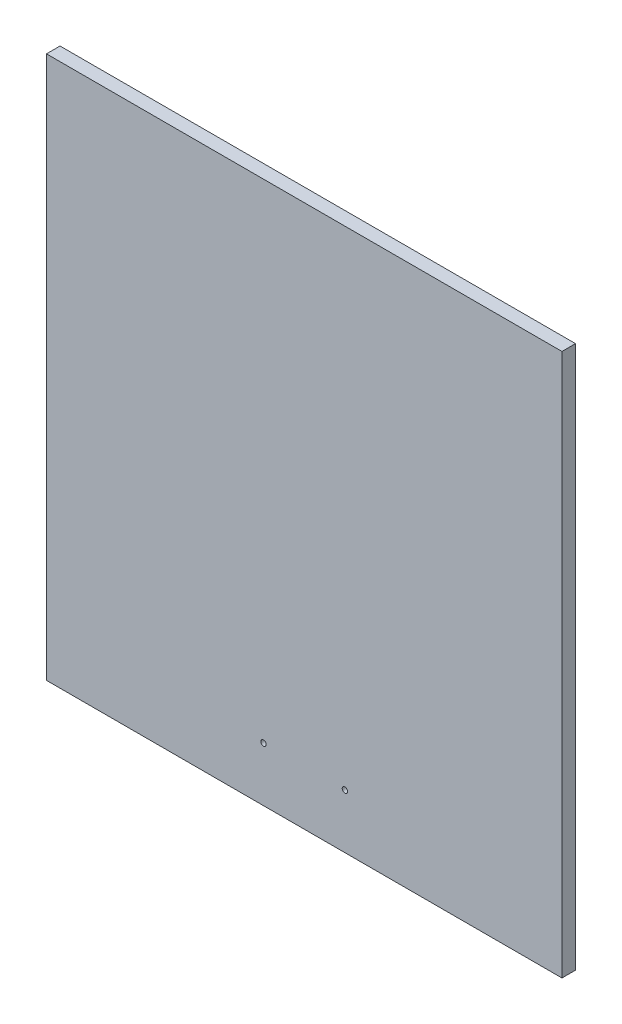
ISO-10303-21;
HEADER;
FILE_DESCRIPTION(('STEP AP214'),'2;1');
FILE_NAME('part.step','',(''),(''),'','','');
FILE_SCHEMA(('AUTOMOTIVE_DESIGN { 1 0 10303 214 1 1 1 1 }'));
ENDSEC;
DATA;
#1=APPLICATION_CONTEXT('core data for automotive mechanical design processes');
#2=APPLICATION_PROTOCOL_DEFINITION('international standard','automotive_design',2000,#1);
#3=PRODUCT_CONTEXT('',#1,'mechanical');
#4=PRODUCT('Part','Part','',(#3));
#5=PRODUCT_RELATED_PRODUCT_CATEGORY('part','',(#4));
#6=PRODUCT_DEFINITION_FORMATION('','',#4);
#7=PRODUCT_DEFINITION_CONTEXT('part definition',#1,'design');
#8=PRODUCT_DEFINITION('design','',#6,#7);
#9=PRODUCT_DEFINITION_SHAPE('','',#8);
#10=(LENGTH_UNIT() NAMED_UNIT(*) SI_UNIT(.MILLI.,.METRE.));
#11=(NAMED_UNIT(*) PLANE_ANGLE_UNIT() SI_UNIT($,.RADIAN.));
#12=(NAMED_UNIT(*) SI_UNIT($,.STERADIAN.) SOLID_ANGLE_UNIT());
#13=UNCERTAINTY_MEASURE_WITH_UNIT(LENGTH_MEASURE(1.E-05),#10,'distance_accuracy_value','');
#14=(GEOMETRIC_REPRESENTATION_CONTEXT(3) GLOBAL_UNCERTAINTY_ASSIGNED_CONTEXT((#13)) GLOBAL_UNIT_ASSIGNED_CONTEXT((#10,
#11,#12)) REPRESENTATION_CONTEXT('',''));
#15=CARTESIAN_POINT('',(0.,0.,0.));
#16=DIRECTION('',(0.,0.,1.));
#17=DIRECTION('',(1.,0.,0.));
#18=AXIS2_PLACEMENT_3D('',#15,#16,#17);
#19=CARTESIAN_POINT('',(95.,-100.,5.));
#20=DIRECTION('',(-1.,0.,0.));
#21=DIRECTION('',(0.,0.,1.));
#22=AXIS2_PLACEMENT_3D('',#19,#20,#21);
#23=PLANE('',#22);
#24=DIRECTION('',(0.,1.,0.));
#25=VECTOR('',#24,1.);
#26=CARTESIAN_POINT('',(95.,-100.,0.));
#27=LINE('',#26,#25);
#28=CARTESIAN_POINT('',(95.,-100.,0.));
#29=VERTEX_POINT('',#28);
#30=CARTESIAN_POINT('',(95.,100.,0.));
#31=VERTEX_POINT('',#30);
#32=EDGE_CURVE('E99',#29,#31,#27,.T.);
#33=ORIENTED_EDGE('',*,*,#32,.T.);
#34=DIRECTION('',(0.,0.,-1.));
#35=VECTOR('',#34,1.);
#36=CARTESIAN_POINT('',(95.,100.,5.));
#37=LINE('',#36,#35);
#38=CARTESIAN_POINT('',(95.,100.,5.));
#39=VERTEX_POINT('',#38);
#40=EDGE_CURVE('E11',#39,#31,#37,.T.);
#41=ORIENTED_EDGE('',*,*,#40,.F.);
#42=DIRECTION('',(0.,1.,0.));
#43=VECTOR('',#42,1.);
#44=CARTESIAN_POINT('',(95.,-100.,5.));
#45=LINE('',#44,#43);
#46=CARTESIAN_POINT('',(95.,-100.,5.));
#47=VERTEX_POINT('',#46);
#48=EDGE_CURVE('E86',#47,#39,#45,.T.);
#49=ORIENTED_EDGE('',*,*,#48,.F.);
#50=DIRECTION('',(0.,0.,-1.));
#51=VECTOR('',#50,1.);
#52=CARTESIAN_POINT('',(95.,-100.,5.));
#53=LINE('',#52,#51);
#54=EDGE_CURVE('E95',#47,#29,#53,.T.);
#55=ORIENTED_EDGE('',*,*,#54,.T.);
#56=EDGE_LOOP('',(#33,#41,#49,#55));
#57=FACE_BOUND('',#56,.T.);
#58=ADVANCED_FACE('F33',(#57),#23,.F.);
#59=CARTESIAN_POINT('',(-95.,100.,5.));
#60=DIRECTION('',(0.,-1.,0.));
#61=DIRECTION('',(0.,0.,-1.));
#62=AXIS2_PLACEMENT_3D('',#59,#60,#61);
#63=PLANE('',#62);
#64=DIRECTION('',(-1.,0.,0.));
#65=VECTOR('',#64,1.);
#66=CARTESIAN_POINT('',(-95.,100.,0.));
#67=LINE('',#66,#65);
#68=CARTESIAN_POINT('',(-95.,100.,0.));
#69=VERTEX_POINT('',#68);
#70=EDGE_CURVE('E90',#31,#69,#67,.T.);
#71=ORIENTED_EDGE('',*,*,#70,.T.);
#72=DIRECTION('',(0.,0.,-1.));
#73=VECTOR('',#72,1.);
#74=CARTESIAN_POINT('',(-95.,100.,5.));
#75=LINE('',#74,#73);
#76=CARTESIAN_POINT('',(-95.,100.,5.));
#77=VERTEX_POINT('',#76);
#78=EDGE_CURVE('E42',#77,#69,#75,.T.);
#79=ORIENTED_EDGE('',*,*,#78,.F.);
#80=DIRECTION('',(-1.,0.,0.));
#81=VECTOR('',#80,1.);
#82=CARTESIAN_POINT('',(-95.,100.,5.));
#83=LINE('',#82,#81);
#84=EDGE_CURVE('E81',#39,#77,#83,.T.);
#85=ORIENTED_EDGE('',*,*,#84,.F.);
#86=ORIENTED_EDGE('',*,*,#40,.T.);
#87=EDGE_LOOP('',(#71,#79,#85,#86));
#88=FACE_BOUND('',#87,.T.);
#89=ADVANCED_FACE('F89',(#88),#63,.F.);
#90=CARTESIAN_POINT('',(-95.,-100.,5.));
#91=DIRECTION('',(1.,0.,0.));
#92=DIRECTION('',(0.,0.,-1.));
#93=AXIS2_PLACEMENT_3D('',#90,#91,#92);
#94=PLANE('',#93);
#95=DIRECTION('',(0.,-1.,0.));
#96=VECTOR('',#95,1.);
#97=CARTESIAN_POINT('',(-95.,-100.,0.));
#98=LINE('',#97,#96);
#99=CARTESIAN_POINT('',(-95.,-100.,0.));
#100=VERTEX_POINT('',#99);
#101=EDGE_CURVE('E68',#69,#100,#98,.T.);
#102=ORIENTED_EDGE('',*,*,#101,.T.);
#103=DIRECTION('',(0.,0.,-1.));
#104=VECTOR('',#103,1.);
#105=CARTESIAN_POINT('',(-95.,-100.,5.));
#106=LINE('',#105,#104);
#107=CARTESIAN_POINT('',(-95.,-100.,5.));
#108=VERTEX_POINT('',#107);
#109=EDGE_CURVE('E91',#108,#100,#106,.T.);
#110=ORIENTED_EDGE('',*,*,#109,.F.);
#111=DIRECTION('',(0.,-1.,0.));
#112=VECTOR('',#111,1.);
#113=CARTESIAN_POINT('',(-95.,-100.,5.));
#114=LINE('',#113,#112);
#115=EDGE_CURVE('E84',#77,#108,#114,.T.);
#116=ORIENTED_EDGE('',*,*,#115,.F.);
#117=ORIENTED_EDGE('',*,*,#78,.T.);
#118=EDGE_LOOP('',(#102,#110,#116,#117));
#119=FACE_BOUND('',#118,.T.);
#120=ADVANCED_FACE('F93',(#119),#94,.F.);
#121=CARTESIAN_POINT('',(-95.,-100.,5.));
#122=DIRECTION('',(0.,1.,0.));
#123=DIRECTION('',(0.,0.,1.));
#124=AXIS2_PLACEMENT_3D('',#121,#122,#123);
#125=PLANE('',#124);
#126=DIRECTION('',(1.,0.,0.));
#127=VECTOR('',#126,1.);
#128=CARTESIAN_POINT('',(-95.,-100.,0.));
#129=LINE('',#128,#127);
#130=EDGE_CURVE('E74',#100,#29,#129,.T.);
#131=ORIENTED_EDGE('',*,*,#130,.T.);
#132=ORIENTED_EDGE('',*,*,#54,.F.);
#133=DIRECTION('',(1.,0.,0.));
#134=VECTOR('',#133,1.);
#135=CARTESIAN_POINT('',(-95.,-100.,5.));
#136=LINE('',#135,#134);
#137=EDGE_CURVE('E51',#108,#47,#136,.T.);
#138=ORIENTED_EDGE('',*,*,#137,.F.);
#139=ORIENTED_EDGE('',*,*,#109,.T.);
#140=EDGE_LOOP('',(#131,#132,#138,#139));
#141=FACE_BOUND('',#140,.T.);
#142=ADVANCED_FACE('F125',(#141),#125,.F.);
#143=CARTESIAN_POINT('',(0.,0.,5.));
#144=DIRECTION('',(0.,0.,-1.));
#145=DIRECTION('',(-1.,0.,0.));
#146=AXIS2_PLACEMENT_3D('',#143,#144,#145);
#147=PLANE('',#146);
#148=CARTESIAN_POINT('',(-15.,-80.,5.));
#149=DIRECTION('',(0.,0.,1.));
#150=DIRECTION('',(1.,0.,0.));
#151=AXIS2_PLACEMENT_3D('',#148,#149,#150);
#152=CIRCLE('',#151,1.);
#153=CARTESIAN_POINT('',(-14.,-80.,5.));
#154=VERTEX_POINT('',#153);
#155=EDGE_CURVE('E108',#154,#154,#152,.T.);
#156=ORIENTED_EDGE('',*,*,#155,.F.);
#157=EDGE_LOOP('',(#156));
#158=FACE_BOUND('',#157,.T.);
#159=CARTESIAN_POINT('',(15.,-80.,5.));
#160=DIRECTION('',(0.,0.,1.));
#161=DIRECTION('',(-1.,0.,0.));
#162=AXIS2_PLACEMENT_3D('',#159,#160,#161);
#163=CIRCLE('',#162,1.);
#164=CARTESIAN_POINT('',(14.,-80.,5.));
#165=VERTEX_POINT('',#164);
#166=EDGE_CURVE('E113',#165,#165,#163,.T.);
#167=ORIENTED_EDGE('',*,*,#166,.F.);
#168=EDGE_LOOP('',(#167));
#169=FACE_BOUND('',#168,.T.);
#170=ORIENTED_EDGE('',*,*,#48,.T.);
#171=ORIENTED_EDGE('',*,*,#84,.T.);
#172=ORIENTED_EDGE('',*,*,#115,.T.);
#173=ORIENTED_EDGE('',*,*,#137,.T.);
#174=EDGE_LOOP('',(#170,#171,#172,#173));
#175=FACE_BOUND('',#174,.T.);
#176=ADVANCED_FACE('F82',(#158,#169,#175),#147,.F.);
#177=CARTESIAN_POINT('',(0.,0.,0.));
#178=DIRECTION('',(0.,0.,-1.));
#179=DIRECTION('',(-1.,0.,0.));
#180=AXIS2_PLACEMENT_3D('',#177,#178,#179);
#181=PLANE('',#180);
#182=CARTESIAN_POINT('',(-15.,-80.,0.));
#183=DIRECTION('',(0.,0.,-1.));
#184=DIRECTION('',(-1.,0.,0.));
#185=AXIS2_PLACEMENT_3D('',#182,#183,#184);
#186=CIRCLE('',#185,1.);
#187=CARTESIAN_POINT('',(-16.,-80.,0.));
#188=VERTEX_POINT('',#187);
#189=EDGE_CURVE('E36',#188,#188,#186,.T.);
#190=ORIENTED_EDGE('',*,*,#189,.F.);
#191=EDGE_LOOP('',(#190));
#192=FACE_BOUND('',#191,.T.);
#193=CARTESIAN_POINT('',(15.,-80.,0.));
#194=DIRECTION('',(0.,0.,-1.));
#195=DIRECTION('',(-1.,0.,0.));
#196=AXIS2_PLACEMENT_3D('',#193,#194,#195);
#197=CIRCLE('',#196,1.);
#198=CARTESIAN_POINT('',(14.,-80.,0.));
#199=VERTEX_POINT('',#198);
#200=EDGE_CURVE('E106',#199,#199,#197,.T.);
#201=ORIENTED_EDGE('',*,*,#200,.F.);
#202=EDGE_LOOP('',(#201));
#203=FACE_BOUND('',#202,.T.);
#204=ORIENTED_EDGE('',*,*,#32,.F.);
#205=ORIENTED_EDGE('',*,*,#130,.F.);
#206=ORIENTED_EDGE('',*,*,#101,.F.);
#207=ORIENTED_EDGE('',*,*,#70,.F.);
#208=EDGE_LOOP('',(#204,#205,#206,#207));
#209=FACE_BOUND('',#208,.T.);
#210=ADVANCED_FACE('F124',(#192,#203,#209),#181,.T.);
#211=CARTESIAN_POINT('',(15.,-80.,-5.));
#212=DIRECTION('',(0.,0.,1.));
#213=DIRECTION('',(1.,0.,0.));
#214=AXIS2_PLACEMENT_3D('',#211,#212,#213);
#215=CYLINDRICAL_SURFACE('',#214,1.);
#216=ORIENTED_EDGE('',*,*,#200,.T.);
#217=EDGE_LOOP('',(#216));
#218=FACE_BOUND('',#217,.T.);
#219=ORIENTED_EDGE('',*,*,#166,.T.);
#220=EDGE_LOOP('',(#219));
#221=FACE_BOUND('',#220,.T.);
#222=ADVANCED_FACE('F121',(#218,#221),#215,.F.);
#223=CARTESIAN_POINT('',(-15.,-80.,-5.));
#224=DIRECTION('',(0.,0.,1.));
#225=DIRECTION('',(1.,0.,0.));
#226=AXIS2_PLACEMENT_3D('',#223,#224,#225);
#227=CYLINDRICAL_SURFACE('',#226,1.);
#228=ORIENTED_EDGE('',*,*,#189,.T.);
#229=EDGE_LOOP('',(#228));
#230=FACE_BOUND('',#229,.T.);
#231=ORIENTED_EDGE('',*,*,#155,.T.);
#232=EDGE_LOOP('',(#231));
#233=FACE_BOUND('',#232,.T.);
#234=ADVANCED_FACE('F172',(#230,#233),#227,.F.);
#235=CLOSED_SHELL('',(#58,#89,#120,#142,#176,#210,#222,#234));
#236=MANIFOLD_SOLID_BREP('B2',#235);
#237=ADVANCED_BREP_SHAPE_REPRESENTATION('',(#18,#236),#14);
#238=SHAPE_DEFINITION_REPRESENTATION(#9,#237);
ENDSEC;
END-ISO-10303-21;
